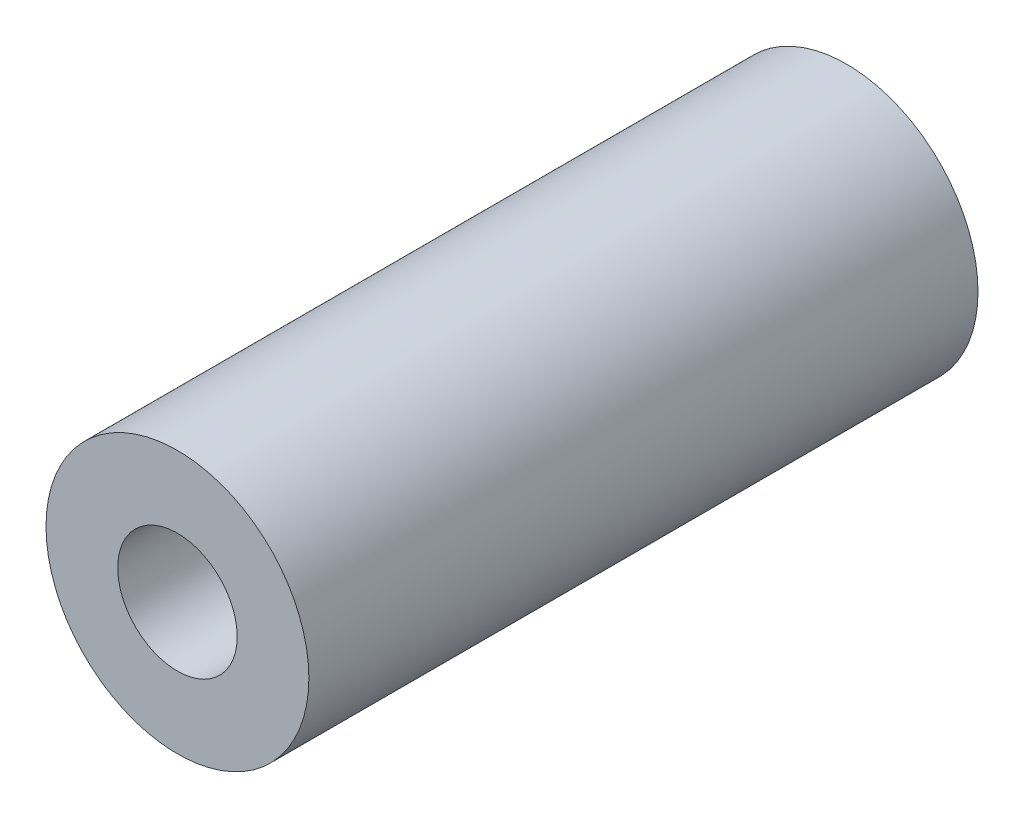
ISO-10303-21;
HEADER;
FILE_DESCRIPTION(('STEP AP214'),'2;1');
FILE_NAME('part.step','',(''),(''),'','','');
FILE_SCHEMA(('AUTOMOTIVE_DESIGN { 1 0 10303 214 1 1 1 1 }'));
ENDSEC;
DATA;
#1=APPLICATION_CONTEXT('core data for automotive mechanical design processes');
#2=APPLICATION_PROTOCOL_DEFINITION('international standard','automotive_design',2000,#1);
#3=PRODUCT_CONTEXT('',#1,'mechanical');
#4=PRODUCT('Part','Part','',(#3));
#5=PRODUCT_RELATED_PRODUCT_CATEGORY('part','',(#4));
#6=PRODUCT_DEFINITION_FORMATION('','',#4);
#7=PRODUCT_DEFINITION_CONTEXT('part definition',#1,'design');
#8=PRODUCT_DEFINITION('design','',#6,#7);
#9=PRODUCT_DEFINITION_SHAPE('','',#8);
#10=(LENGTH_UNIT() NAMED_UNIT(*) SI_UNIT(.MILLI.,.METRE.));
#11=(NAMED_UNIT(*) PLANE_ANGLE_UNIT() SI_UNIT($,.RADIAN.));
#12=(NAMED_UNIT(*) SI_UNIT($,.STERADIAN.) SOLID_ANGLE_UNIT());
#13=UNCERTAINTY_MEASURE_WITH_UNIT(LENGTH_MEASURE(1.E-05),#10,'distance_accuracy_value','');
#14=(GEOMETRIC_REPRESENTATION_CONTEXT(3) GLOBAL_UNCERTAINTY_ASSIGNED_CONTEXT((#13)) GLOBAL_UNIT_ASSIGNED_CONTEXT((#10,
#11,#12)) REPRESENTATION_CONTEXT('',''));
#15=CARTESIAN_POINT('',(0.,0.,0.));
#16=DIRECTION('',(0.,0.,1.));
#17=DIRECTION('',(1.,0.,0.));
#18=AXIS2_PLACEMENT_3D('',#15,#16,#17);
#19=CARTESIAN_POINT('',(0.,0.,56.));
#20=DIRECTION('',(0.,0.,-1.));
#21=DIRECTION('',(-1.,0.,0.));
#22=AXIS2_PLACEMENT_3D('',#19,#20,#21);
#23=CYLINDRICAL_SURFACE('',#22,8.);
#24=CARTESIAN_POINT('',(0.,0.,26.));
#25=DIRECTION('',(0.,0.,1.));
#26=DIRECTION('',(1.,0.,0.));
#27=AXIS2_PLACEMENT_3D('',#24,#25,#26);
#28=CIRCLE('',#27,8.);
#29=CARTESIAN_POINT('',(8.,0.,26.));
#30=VERTEX_POINT('',#29);
#31=EDGE_CURVE('E161',#30,#30,#28,.T.);
#32=ORIENTED_EDGE('',*,*,#31,.F.);
#33=EDGE_LOOP('',(#32));
#34=FACE_BOUND('',#33,.T.);
#35=CARTESIAN_POINT('',(0.,0.,41.));
#36=DIRECTION('',(0.,0.,1.));
#37=DIRECTION('',(1.,0.,0.));
#38=AXIS2_PLACEMENT_3D('',#35,#36,#37);
#39=CIRCLE('',#38,8.);
#40=CARTESIAN_POINT('',(8.,0.,41.));
#41=VERTEX_POINT('',#40);
#42=EDGE_CURVE('E40',#41,#41,#39,.T.);
#43=ORIENTED_EDGE('',*,*,#42,.T.);
#44=EDGE_LOOP('',(#43));
#45=FACE_BOUND('',#44,.T.);
#46=ADVANCED_FACE('F36',(#34,#45),#23,.F.);
#47=CARTESIAN_POINT('',(0.,0.,26.));
#48=DIRECTION('',(0.,0.,1.));
#49=DIRECTION('',(1.,0.,0.));
#50=AXIS2_PLACEMENT_3D('',#47,#48,#49);
#51=PLANE('',#50);
#52=DIRECTION('',(-1.,0.,0.));
#53=VECTOR('',#52,1.);
#54=CARTESIAN_POINT('',(-6.,5.,26.));
#55=LINE('',#54,#53);
#56=CARTESIAN_POINT('',(6.,5.,26.));
#57=VERTEX_POINT('',#56);
#58=CARTESIAN_POINT('',(-6.,5.,26.));
#59=VERTEX_POINT('',#58);
#60=EDGE_CURVE('E85',#57,#59,#55,.T.);
#61=ORIENTED_EDGE('',*,*,#60,.F.);
#62=DIRECTION('',(0.,1.,0.));
#63=VECTOR('',#62,1.);
#64=CARTESIAN_POINT('',(6.,5.,26.));
#65=LINE('',#64,#63);
#66=CARTESIAN_POINT('',(6.,-5.,26.));
#67=VERTEX_POINT('',#66);
#68=EDGE_CURVE('E78',#67,#57,#65,.T.);
#69=ORIENTED_EDGE('',*,*,#68,.F.);
#70=DIRECTION('',(1.,0.,0.));
#71=VECTOR('',#70,1.);
#72=CARTESIAN_POINT('',(-6.,-5.,26.));
#73=LINE('',#72,#71);
#74=CARTESIAN_POINT('',(-6.,-5.,26.));
#75=VERTEX_POINT('',#74);
#76=EDGE_CURVE('E100',#75,#67,#73,.T.);
#77=ORIENTED_EDGE('',*,*,#76,.F.);
#78=DIRECTION('',(0.,-1.,0.));
#79=VECTOR('',#78,1.);
#80=CARTESIAN_POINT('',(-6.,5.,26.));
#81=LINE('',#80,#79);
#82=EDGE_CURVE('E98',#59,#75,#81,.T.);
#83=ORIENTED_EDGE('',*,*,#82,.F.);
#84=EDGE_LOOP('',(#61,#69,#77,#83));
#85=FACE_BOUND('',#84,.T.);
#86=ORIENTED_EDGE('',*,*,#31,.T.);
#87=EDGE_LOOP('',(#86));
#88=FACE_BOUND('',#87,.T.);
#89=ADVANCED_FACE('F96',(#85,#88),#51,.T.);
#90=CARTESIAN_POINT('',(0.,0.,0.));
#91=DIRECTION('',(0.,0.,1.));
#92=DIRECTION('',(1.,0.,0.));
#93=AXIS2_PLACEMENT_3D('',#90,#91,#92);
#94=PLANE('',#93);
#95=CARTESIAN_POINT('',(0.,0.,0.));
#96=DIRECTION('',(0.,0.,1.));
#97=DIRECTION('',(1.,0.,0.));
#98=AXIS2_PLACEMENT_3D('',#95,#96,#97);
#99=CIRCLE('',#98,11.);
#100=CARTESIAN_POINT('',(11.,0.,0.));
#101=VERTEX_POINT('',#100);
#102=EDGE_CURVE('E11',#101,#101,#99,.T.);
#103=ORIENTED_EDGE('',*,*,#102,.F.);
#104=EDGE_LOOP('',(#103));
#105=FACE_BOUND('',#104,.T.);
#106=DIRECTION('',(0.,1.,0.));
#107=VECTOR('',#106,1.);
#108=CARTESIAN_POINT('',(6.,5.,0.));
#109=LINE('',#108,#107);
#110=CARTESIAN_POINT('',(6.,-5.,0.));
#111=VERTEX_POINT('',#110);
#112=CARTESIAN_POINT('',(6.,5.,0.));
#113=VERTEX_POINT('',#112);
#114=EDGE_CURVE('E60',#111,#113,#109,.T.);
#115=ORIENTED_EDGE('',*,*,#114,.T.);
#116=DIRECTION('',(-1.,0.,0.));
#117=VECTOR('',#116,1.);
#118=CARTESIAN_POINT('',(-6.,5.,0.));
#119=LINE('',#118,#117);
#120=CARTESIAN_POINT('',(-6.,5.,0.));
#121=VERTEX_POINT('',#120);
#122=EDGE_CURVE('E92',#113,#121,#119,.T.);
#123=ORIENTED_EDGE('',*,*,#122,.T.);
#124=DIRECTION('',(0.,-1.,0.));
#125=VECTOR('',#124,1.);
#126=CARTESIAN_POINT('',(-6.,5.,0.));
#127=LINE('',#126,#125);
#128=CARTESIAN_POINT('',(-6.,-5.,0.));
#129=VERTEX_POINT('',#128);
#130=EDGE_CURVE('E108',#121,#129,#127,.T.);
#131=ORIENTED_EDGE('',*,*,#130,.T.);
#132=DIRECTION('',(1.,0.,0.));
#133=VECTOR('',#132,1.);
#134=CARTESIAN_POINT('',(-6.,-5.,0.));
#135=LINE('',#134,#133);
#136=EDGE_CURVE('E86',#129,#111,#135,.T.);
#137=ORIENTED_EDGE('',*,*,#136,.T.);
#138=EDGE_LOOP('',(#115,#123,#131,#137));
#139=FACE_BOUND('',#138,.T.);
#140=ADVANCED_FACE('F119',(#105,#139),#94,.F.);
#141=CARTESIAN_POINT('',(0.,0.,26.));
#142=DIRECTION('',(0.,0.,-1.));
#143=DIRECTION('',(-1.,0.,0.));
#144=AXIS2_PLACEMENT_3D('',#141,#142,#143);
#145=CYLINDRICAL_SURFACE('',#144,11.);
#146=CARTESIAN_POINT('',(0.,0.,56.));
#147=DIRECTION('',(0.,0.,1.));
#148=DIRECTION('',(1.,0.,0.));
#149=AXIS2_PLACEMENT_3D('',#146,#147,#148);
#150=CIRCLE('',#149,11.);
#151=CARTESIAN_POINT('',(11.,0.,56.));
#152=VERTEX_POINT('',#151);
#153=EDGE_CURVE('E106',#152,#152,#150,.T.);
#154=ORIENTED_EDGE('',*,*,#153,.F.);
#155=EDGE_LOOP('',(#154));
#156=FACE_BOUND('',#155,.T.);
#157=ORIENTED_EDGE('',*,*,#102,.T.);
#158=EDGE_LOOP('',(#157));
#159=FACE_BOUND('',#158,.T.);
#160=ADVANCED_FACE('F38',(#156,#159),#145,.T.);
#161=CARTESIAN_POINT('',(6.,5.,26.));
#162=DIRECTION('',(-1.,0.,0.));
#163=DIRECTION('',(0.,-1.,0.));
#164=AXIS2_PLACEMENT_3D('',#161,#162,#163);
#165=PLANE('',#164);
#166=ORIENTED_EDGE('',*,*,#114,.F.);
#167=DIRECTION('',(0.,0.,-1.));
#168=VECTOR('',#167,1.);
#169=CARTESIAN_POINT('',(6.,-5.,26.));
#170=LINE('',#169,#168);
#171=EDGE_CURVE('E81',#67,#111,#170,.T.);
#172=ORIENTED_EDGE('',*,*,#171,.F.);
#173=ORIENTED_EDGE('',*,*,#68,.T.);
#174=DIRECTION('',(0.,0.,-1.));
#175=VECTOR('',#174,1.);
#176=CARTESIAN_POINT('',(6.,5.,26.));
#177=LINE('',#176,#175);
#178=EDGE_CURVE('E45',#57,#113,#177,.T.);
#179=ORIENTED_EDGE('',*,*,#178,.T.);
#180=EDGE_LOOP('',(#166,#172,#173,#179));
#181=FACE_BOUND('',#180,.T.);
#182=ADVANCED_FACE('F80',(#181),#165,.T.);
#183=CARTESIAN_POINT('',(-6.,5.,26.));
#184=DIRECTION('',(0.,-1.,0.));
#185=DIRECTION('',(0.,0.,-1.));
#186=AXIS2_PLACEMENT_3D('',#183,#184,#185);
#187=PLANE('',#186);
#188=ORIENTED_EDGE('',*,*,#122,.F.);
#189=ORIENTED_EDGE('',*,*,#178,.F.);
#190=ORIENTED_EDGE('',*,*,#60,.T.);
#191=DIRECTION('',(0.,0.,-1.));
#192=VECTOR('',#191,1.);
#193=CARTESIAN_POINT('',(-6.,5.,26.));
#194=LINE('',#193,#192);
#195=EDGE_CURVE('E93',#59,#121,#194,.T.);
#196=ORIENTED_EDGE('',*,*,#195,.T.);
#197=EDGE_LOOP('',(#188,#189,#190,#196));
#198=FACE_BOUND('',#197,.T.);
#199=ADVANCED_FACE('F89',(#198),#187,.T.);
#200=CARTESIAN_POINT('',(-6.,5.,26.));
#201=DIRECTION('',(1.,0.,0.));
#202=DIRECTION('',(0.,1.,0.));
#203=AXIS2_PLACEMENT_3D('',#200,#201,#202);
#204=PLANE('',#203);
#205=ORIENTED_EDGE('',*,*,#130,.F.);
#206=ORIENTED_EDGE('',*,*,#195,.F.);
#207=ORIENTED_EDGE('',*,*,#82,.T.);
#208=DIRECTION('',(0.,0.,-1.));
#209=VECTOR('',#208,1.);
#210=CARTESIAN_POINT('',(-6.,-5.,26.));
#211=LINE('',#210,#209);
#212=EDGE_CURVE('E52',#75,#129,#211,.T.);
#213=ORIENTED_EDGE('',*,*,#212,.T.);
#214=EDGE_LOOP('',(#205,#206,#207,#213));
#215=FACE_BOUND('',#214,.T.);
#216=ADVANCED_FACE('F117',(#215),#204,.T.);
#217=CARTESIAN_POINT('',(-6.,-5.,26.));
#218=DIRECTION('',(0.,1.,0.));
#219=DIRECTION('',(0.,0.,1.));
#220=AXIS2_PLACEMENT_3D('',#217,#218,#219);
#221=PLANE('',#220);
#222=ORIENTED_EDGE('',*,*,#136,.F.);
#223=ORIENTED_EDGE('',*,*,#212,.F.);
#224=ORIENTED_EDGE('',*,*,#76,.T.);
#225=ORIENTED_EDGE('',*,*,#171,.T.);
#226=EDGE_LOOP('',(#222,#223,#224,#225));
#227=FACE_BOUND('',#226,.T.);
#228=ADVANCED_FACE('F120',(#227),#221,.T.);
#229=CARTESIAN_POINT('',(0.,0.,56.));
#230=DIRECTION('',(0.,0.,1.));
#231=DIRECTION('',(1.,0.,0.));
#232=AXIS2_PLACEMENT_3D('',#229,#230,#231);
#233=PLANE('',#232);
#234=ORIENTED_EDGE('',*,*,#153,.T.);
#235=EDGE_LOOP('',(#234));
#236=FACE_BOUND('',#235,.T.);
#237=CARTESIAN_POINT('',(0.,0.,56.));
#238=DIRECTION('',(0.,0.,1.));
#239=DIRECTION('',(1.,0.,0.));
#240=AXIS2_PLACEMENT_3D('',#237,#238,#239);
#241=CIRCLE('',#240,5.);
#242=CARTESIAN_POINT('',(5.,0.,56.));
#243=VERTEX_POINT('',#242);
#244=EDGE_CURVE('E156',#243,#243,#241,.T.);
#245=ORIENTED_EDGE('',*,*,#244,.F.);
#246=EDGE_LOOP('',(#245));
#247=FACE_BOUND('',#246,.T.);
#248=ADVANCED_FACE('F122',(#236,#247),#233,.T.);
#249=CARTESIAN_POINT('',(0.,0.,41.));
#250=DIRECTION('',(0.,0.,1.));
#251=DIRECTION('',(1.,0.,0.));
#252=AXIS2_PLACEMENT_3D('',#249,#250,#251);
#253=PLANE('',#252);
#254=CARTESIAN_POINT('',(0.,0.,41.));
#255=DIRECTION('',(0.,0.,1.));
#256=DIRECTION('',(1.,0.,0.));
#257=AXIS2_PLACEMENT_3D('',#254,#255,#256);
#258=CIRCLE('',#257,5.);
#259=CARTESIAN_POINT('',(5.,0.,41.));
#260=VERTEX_POINT('',#259);
#261=EDGE_CURVE('E153',#260,#260,#258,.T.);
#262=ORIENTED_EDGE('',*,*,#261,.T.);
#263=EDGE_LOOP('',(#262));
#264=FACE_BOUND('',#263,.T.);
#265=ORIENTED_EDGE('',*,*,#42,.F.);
#266=EDGE_LOOP('',(#265));
#267=FACE_BOUND('',#266,.T.);
#268=ADVANCED_FACE('F128',(#264,#267),#253,.F.);
#269=CARTESIAN_POINT('',(0.,0.,41.));
#270=DIRECTION('',(0.,0.,1.));
#271=DIRECTION('',(1.,0.,0.));
#272=AXIS2_PLACEMENT_3D('',#269,#270,#271);
#273=CYLINDRICAL_SURFACE('',#272,5.);
#274=ORIENTED_EDGE('',*,*,#261,.F.);
#275=EDGE_LOOP('',(#274));
#276=FACE_BOUND('',#275,.T.);
#277=ORIENTED_EDGE('',*,*,#244,.T.);
#278=EDGE_LOOP('',(#277));
#279=FACE_BOUND('',#278,.T.);
#280=ADVANCED_FACE('F144',(#276,#279),#273,.F.);
#281=CLOSED_SHELL('',(#46,#89,#140,#160,#182,#199,#216,#228,#248,#268,#280));
#282=MANIFOLD_SOLID_BREP('B2',#281);
#283=ADVANCED_BREP_SHAPE_REPRESENTATION('',(#18,#282),#14);
#284=SHAPE_DEFINITION_REPRESENTATION(#9,#283);
ENDSEC;
END-ISO-10303-21;
